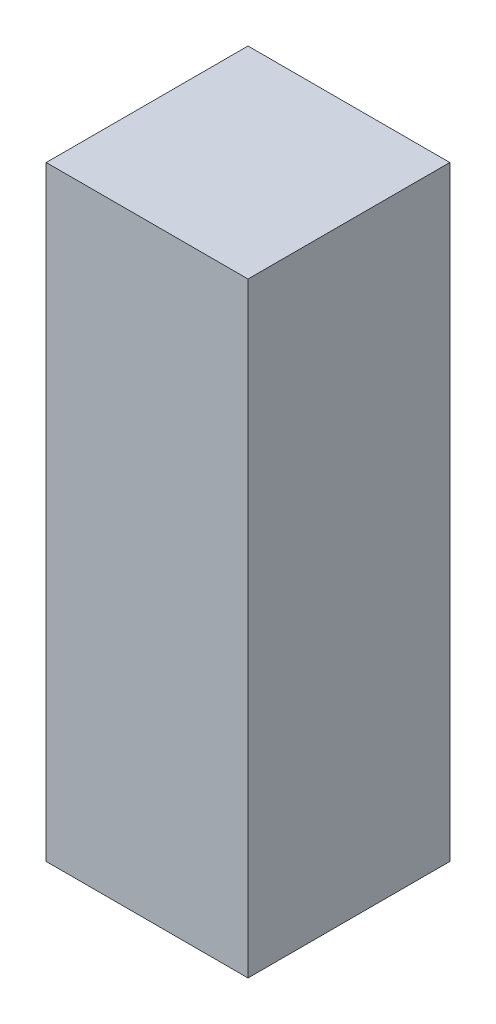
ISO-10303-21;
HEADER;
FILE_DESCRIPTION(('STEP AP214'),'2;1');
FILE_NAME('part.step','',(''),(''),'','','');
FILE_SCHEMA(('AUTOMOTIVE_DESIGN { 1 0 10303 214 1 1 1 1 }'));
ENDSEC;
DATA;
#1=APPLICATION_CONTEXT('core data for automotive mechanical design processes');
#2=APPLICATION_PROTOCOL_DEFINITION('international standard','automotive_design',2000,#1);
#3=PRODUCT_CONTEXT('',#1,'mechanical');
#4=PRODUCT('Part','Part','',(#3));
#5=PRODUCT_RELATED_PRODUCT_CATEGORY('part','',(#4));
#6=PRODUCT_DEFINITION_FORMATION('','',#4);
#7=PRODUCT_DEFINITION_CONTEXT('part definition',#1,'design');
#8=PRODUCT_DEFINITION('design','',#6,#7);
#9=PRODUCT_DEFINITION_SHAPE('','',#8);
#10=(LENGTH_UNIT() NAMED_UNIT(*) SI_UNIT(.MILLI.,.METRE.));
#11=(NAMED_UNIT(*) PLANE_ANGLE_UNIT() SI_UNIT($,.RADIAN.));
#12=(NAMED_UNIT(*) SI_UNIT($,.STERADIAN.) SOLID_ANGLE_UNIT());
#13=UNCERTAINTY_MEASURE_WITH_UNIT(LENGTH_MEASURE(1.E-05),#10,'distance_accuracy_value','');
#14=(GEOMETRIC_REPRESENTATION_CONTEXT(3) GLOBAL_UNCERTAINTY_ASSIGNED_CONTEXT((#13)) GLOBAL_UNIT_ASSIGNED_CONTEXT((#10,
#11,#12)) REPRESENTATION_CONTEXT('',''));
#15=CARTESIAN_POINT('',(0.,0.,0.));
#16=DIRECTION('',(0.,0.,1.));
#17=DIRECTION('',(1.,0.,0.));
#18=AXIS2_PLACEMENT_3D('',#15,#16,#17);
#19=CARTESIAN_POINT('',(36.9332445026954,25.044780119119,6.));
#20=DIRECTION('',(0.,-1.,0.));
#21=DIRECTION('',(0.,0.,-1.));
#22=AXIS2_PLACEMENT_3D('',#19,#20,#21);
#23=PLANE('',#22);
#24=DIRECTION('',(-1.,0.,0.));
#25=VECTOR('',#24,1.);
#26=CARTESIAN_POINT('',(36.9332445026954,25.044780119119,0.));
#27=LINE('',#26,#25);
#28=CARTESIAN_POINT('',(36.9332445026954,25.044780119119,0.));
#29=VERTEX_POINT('',#28);
#30=CARTESIAN_POINT('',(30.9332445026954,25.044780119119,0.));
#31=VERTEX_POINT('',#30);
#32=EDGE_CURVE('E107',#29,#31,#27,.T.);
#33=ORIENTED_EDGE('',*,*,#32,.T.);
#34=DIRECTION('',(0.,0.,-1.));
#35=VECTOR('',#34,1.);
#36=CARTESIAN_POINT('',(30.9332445026954,25.044780119119,6.));
#37=LINE('',#36,#35);
#38=CARTESIAN_POINT('',(30.9332445026954,25.044780119119,6.));
#39=VERTEX_POINT('',#38);
#40=EDGE_CURVE('E11',#39,#31,#37,.T.);
#41=ORIENTED_EDGE('',*,*,#40,.F.);
#42=DIRECTION('',(-1.,0.,0.));
#43=VECTOR('',#42,1.);
#44=CARTESIAN_POINT('',(36.9332445026954,25.044780119119,6.));
#45=LINE('',#44,#43);
#46=CARTESIAN_POINT('',(36.9332445026954,25.044780119119,6.));
#47=VERTEX_POINT('',#46);
#48=EDGE_CURVE('E89',#47,#39,#45,.T.);
#49=ORIENTED_EDGE('',*,*,#48,.F.);
#50=DIRECTION('',(0.,0.,-1.));
#51=VECTOR('',#50,1.);
#52=CARTESIAN_POINT('',(36.9332445026954,25.044780119119,6.));
#53=LINE('',#52,#51);
#54=EDGE_CURVE('E56',#47,#29,#53,.T.);
#55=ORIENTED_EDGE('',*,*,#54,.T.);
#56=EDGE_LOOP('',(#33,#41,#49,#55));
#57=FACE_BOUND('',#56,.T.);
#58=ADVANCED_FACE('F39',(#57),#23,.F.);
#59=CARTESIAN_POINT('',(30.9332445026954,25.044780119119,6.));
#60=DIRECTION('',(1.,0.,0.));
#61=DIRECTION('',(0.,0.,-1.));
#62=AXIS2_PLACEMENT_3D('',#59,#60,#61);
#63=PLANE('',#62);
#64=DIRECTION('',(0.,-1.,0.));
#65=VECTOR('',#64,1.);
#66=CARTESIAN_POINT('',(30.9332445026954,25.044780119119,0.));
#67=LINE('',#66,#65);
#68=CARTESIAN_POINT('',(30.9332445026954,7.04478011911902,0.));
#69=VERTEX_POINT('',#68);
#70=EDGE_CURVE('E95',#31,#69,#67,.T.);
#71=ORIENTED_EDGE('',*,*,#70,.T.);
#72=DIRECTION('',(0.,0.,-1.));
#73=VECTOR('',#72,1.);
#74=CARTESIAN_POINT('',(30.9332445026954,7.04478011911902,6.));
#75=LINE('',#74,#73);
#76=CARTESIAN_POINT('',(30.9332445026954,7.04478011911902,6.));
#77=VERTEX_POINT('',#76);
#78=EDGE_CURVE('E48',#77,#69,#75,.T.);
#79=ORIENTED_EDGE('',*,*,#78,.F.);
#80=DIRECTION('',(0.,-1.,0.));
#81=VECTOR('',#80,1.);
#82=CARTESIAN_POINT('',(30.9332445026954,25.044780119119,6.));
#83=LINE('',#82,#81);
#84=EDGE_CURVE('E81',#39,#77,#83,.T.);
#85=ORIENTED_EDGE('',*,*,#84,.F.);
#86=ORIENTED_EDGE('',*,*,#40,.T.);
#87=EDGE_LOOP('',(#71,#79,#85,#86));
#88=FACE_BOUND('',#87,.T.);
#89=ADVANCED_FACE('F94',(#88),#63,.F.);
#90=CARTESIAN_POINT('',(36.9332445026954,7.04478011911902,6.));
#91=DIRECTION('',(0.,-1.,0.));
#92=DIRECTION('',(0.,0.,-1.));
#93=AXIS2_PLACEMENT_3D('',#90,#91,#92);
#94=PLANE('',#93);
#95=DIRECTION('',(-1.,0.,0.));
#96=VECTOR('',#95,1.);
#97=CARTESIAN_POINT('',(36.9332445026954,7.04478011911902,0.));
#98=LINE('',#97,#96);
#99=CARTESIAN_POINT('',(36.9332445026954,7.04478011911902,0.));
#100=VERTEX_POINT('',#99);
#101=EDGE_CURVE('E112',#100,#69,#98,.T.);
#102=ORIENTED_EDGE('',*,*,#101,.F.);
#103=DIRECTION('',(0.,0.,-1.));
#104=VECTOR('',#103,1.);
#105=CARTESIAN_POINT('',(36.9332445026954,7.04478011911902,6.));
#106=LINE('',#105,#104);
#107=CARTESIAN_POINT('',(36.9332445026954,7.04478011911902,6.));
#108=VERTEX_POINT('',#107);
#109=EDGE_CURVE('E70',#108,#100,#106,.T.);
#110=ORIENTED_EDGE('',*,*,#109,.F.);
#111=DIRECTION('',(-1.,0.,0.));
#112=VECTOR('',#111,1.);
#113=CARTESIAN_POINT('',(36.9332445026954,7.04478011911902,6.));
#114=LINE('',#113,#112);
#115=EDGE_CURVE('E88',#108,#77,#114,.T.);
#116=ORIENTED_EDGE('',*,*,#115,.T.);
#117=ORIENTED_EDGE('',*,*,#78,.T.);
#118=EDGE_LOOP('',(#102,#110,#116,#117));
#119=FACE_BOUND('',#118,.T.);
#120=ADVANCED_FACE('F99',(#119),#94,.T.);
#121=CARTESIAN_POINT('',(36.9332445026954,25.044780119119,6.));
#122=DIRECTION('',(1.,0.,0.));
#123=DIRECTION('',(0.,0.,-1.));
#124=AXIS2_PLACEMENT_3D('',#121,#122,#123);
#125=PLANE('',#124);
#126=DIRECTION('',(0.,-1.,0.));
#127=VECTOR('',#126,1.);
#128=CARTESIAN_POINT('',(36.9332445026954,25.044780119119,0.));
#129=LINE('',#128,#127);
#130=EDGE_CURVE('E115',#29,#100,#129,.T.);
#131=ORIENTED_EDGE('',*,*,#130,.F.);
#132=ORIENTED_EDGE('',*,*,#54,.F.);
#133=DIRECTION('',(0.,-1.,0.));
#134=VECTOR('',#133,1.);
#135=CARTESIAN_POINT('',(36.9332445026954,25.044780119119,6.));
#136=LINE('',#135,#134);
#137=EDGE_CURVE('E101',#47,#108,#136,.T.);
#138=ORIENTED_EDGE('',*,*,#137,.T.);
#139=ORIENTED_EDGE('',*,*,#109,.T.);
#140=EDGE_LOOP('',(#131,#132,#138,#139));
#141=FACE_BOUND('',#140,.T.);
#142=ADVANCED_FACE('F125',(#141),#125,.T.);
#143=CARTESIAN_POINT('',(0.,0.,6.));
#144=DIRECTION('',(0.,0.,1.));
#145=DIRECTION('',(1.,0.,0.));
#146=AXIS2_PLACEMENT_3D('',#143,#144,#145);
#147=PLANE('',#146);
#148=ORIENTED_EDGE('',*,*,#48,.T.);
#149=ORIENTED_EDGE('',*,*,#84,.T.);
#150=ORIENTED_EDGE('',*,*,#115,.F.);
#151=ORIENTED_EDGE('',*,*,#137,.F.);
#152=EDGE_LOOP('',(#148,#149,#150,#151));
#153=FACE_BOUND('',#152,.T.);
#154=ADVANCED_FACE('F85',(#153),#147,.T.);
#155=CARTESIAN_POINT('',(0.,0.,0.));
#156=DIRECTION('',(0.,0.,1.));
#157=DIRECTION('',(1.,0.,0.));
#158=AXIS2_PLACEMENT_3D('',#155,#156,#157);
#159=PLANE('',#158);
#160=ORIENTED_EDGE('',*,*,#32,.F.);
#161=ORIENTED_EDGE('',*,*,#130,.T.);
#162=ORIENTED_EDGE('',*,*,#101,.T.);
#163=ORIENTED_EDGE('',*,*,#70,.F.);
#164=EDGE_LOOP('',(#160,#161,#162,#163));
#165=FACE_BOUND('',#164,.T.);
#166=ADVANCED_FACE('F124',(#165),#159,.F.);
#167=CLOSED_SHELL('',(#58,#89,#120,#142,#154,#166));
#168=MANIFOLD_SOLID_BREP('B2',#167);
#169=ADVANCED_BREP_SHAPE_REPRESENTATION('',(#18,#168),#14);
#170=SHAPE_DEFINITION_REPRESENTATION(#9,#169);
ENDSEC;
END-ISO-10303-21;
